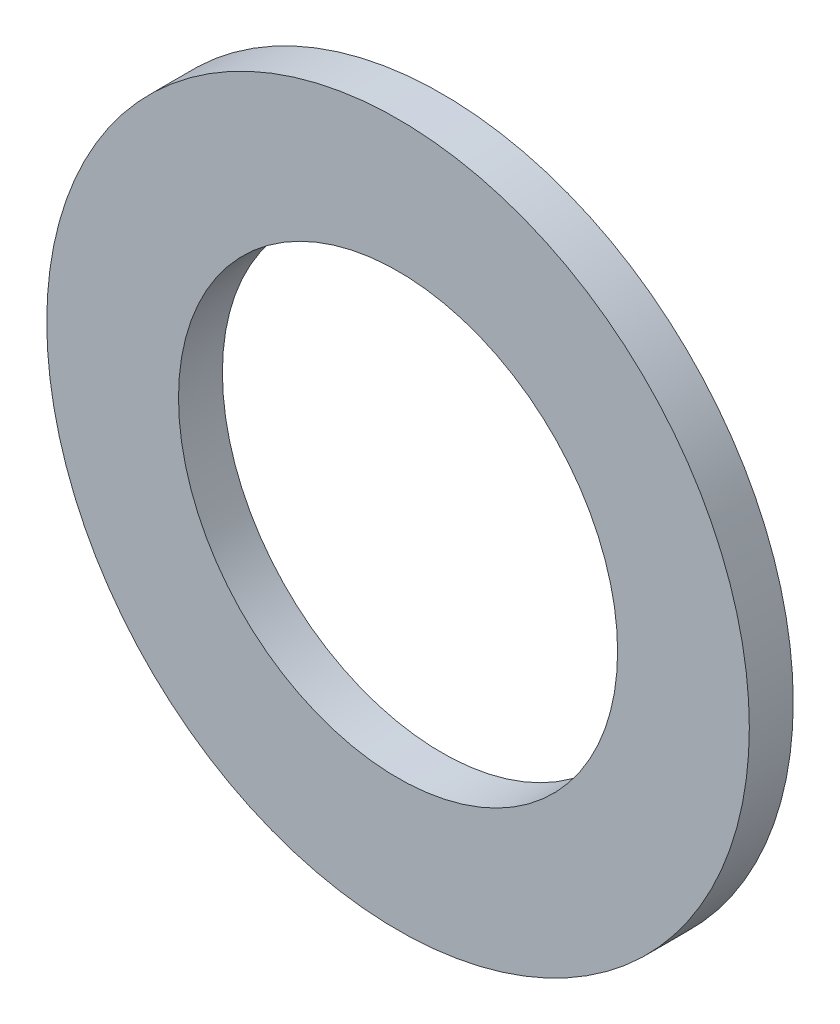
ISO-10303-21;
HEADER;
FILE_DESCRIPTION(('STEP AP214'),'2;1');
FILE_NAME('part.step','',(''),(''),'','','');
FILE_SCHEMA(('AUTOMOTIVE_DESIGN { 1 0 10303 214 1 1 1 1 }'));
ENDSEC;
DATA;
#1=APPLICATION_CONTEXT('core data for automotive mechanical design processes');
#2=APPLICATION_PROTOCOL_DEFINITION('international standard','automotive_design',2000,#1);
#3=PRODUCT_CONTEXT('',#1,'mechanical');
#4=PRODUCT('Part','Part','',(#3));
#5=PRODUCT_RELATED_PRODUCT_CATEGORY('part','',(#4));
#6=PRODUCT_DEFINITION_FORMATION('','',#4);
#7=PRODUCT_DEFINITION_CONTEXT('part definition',#1,'design');
#8=PRODUCT_DEFINITION('design','',#6,#7);
#9=PRODUCT_DEFINITION_SHAPE('','',#8);
#10=(LENGTH_UNIT() NAMED_UNIT(*) SI_UNIT(.MILLI.,.METRE.));
#11=(NAMED_UNIT(*) PLANE_ANGLE_UNIT() SI_UNIT($,.RADIAN.));
#12=(NAMED_UNIT(*) SI_UNIT($,.STERADIAN.) SOLID_ANGLE_UNIT());
#13=UNCERTAINTY_MEASURE_WITH_UNIT(LENGTH_MEASURE(1.E-05),#10,'distance_accuracy_value','');
#14=(GEOMETRIC_REPRESENTATION_CONTEXT(3) GLOBAL_UNCERTAINTY_ASSIGNED_CONTEXT((#13)) GLOBAL_UNIT_ASSIGNED_CONTEXT((#10,
#11,#12)) REPRESENTATION_CONTEXT('',''));
#15=CARTESIAN_POINT('',(0.,0.,0.));
#16=DIRECTION('',(0.,0.,1.));
#17=DIRECTION('',(1.,0.,0.));
#18=AXIS2_PLACEMENT_3D('',#15,#16,#17);
#19=CARTESIAN_POINT('',(0.,0.,1.));
#20=DIRECTION('',(0.,0.,1.));
#21=DIRECTION('',(1.,0.,0.));
#22=AXIS2_PLACEMENT_3D('',#19,#20,#21);
#23=PLANE('',#22);
#24=CARTESIAN_POINT('',(0.,0.,1.));
#25=DIRECTION('',(0.,0.,1.));
#26=DIRECTION('',(1.,0.,0.));
#27=AXIS2_PLACEMENT_3D('',#24,#25,#26);
#28=CIRCLE('',#27,8.);
#29=CARTESIAN_POINT('',(8.,0.,1.));
#30=VERTEX_POINT('',#29);
#31=EDGE_CURVE('E10',#30,#30,#28,.T.);
#32=ORIENTED_EDGE('',*,*,#31,.T.);
#33=EDGE_LOOP('',(#32));
#34=FACE_BOUND('',#33,.T.);
#35=CARTESIAN_POINT('',(0.,0.,1.));
#36=DIRECTION('',(0.,0.,1.));
#37=DIRECTION('',(1.,0.,0.));
#38=AXIS2_PLACEMENT_3D('',#35,#36,#37);
#39=CIRCLE('',#38,5.);
#40=CARTESIAN_POINT('',(5.,0.,1.));
#41=VERTEX_POINT('',#40);
#42=EDGE_CURVE('E50',#41,#41,#39,.T.);
#43=ORIENTED_EDGE('',*,*,#42,.F.);
#44=EDGE_LOOP('',(#43));
#45=FACE_BOUND('',#44,.T.);
#46=ADVANCED_FACE('F37',(#34,#45),#23,.T.);
#47=CARTESIAN_POINT('',(0.,0.,0.));
#48=DIRECTION('',(0.,0.,1.));
#49=DIRECTION('',(1.,0.,0.));
#50=AXIS2_PLACEMENT_3D('',#47,#48,#49);
#51=PLANE('',#50);
#52=CARTESIAN_POINT('',(0.,0.,0.));
#53=DIRECTION('',(0.,0.,1.));
#54=DIRECTION('',(1.,0.,0.));
#55=AXIS2_PLACEMENT_3D('',#52,#53,#54);
#56=CIRCLE('',#55,8.);
#57=CARTESIAN_POINT('',(8.,0.,0.));
#58=VERTEX_POINT('',#57);
#59=EDGE_CURVE('E41',#58,#58,#56,.T.);
#60=ORIENTED_EDGE('',*,*,#59,.F.);
#61=EDGE_LOOP('',(#60));
#62=FACE_BOUND('',#61,.T.);
#63=CARTESIAN_POINT('',(0.,0.,0.));
#64=DIRECTION('',(0.,0.,1.));
#65=DIRECTION('',(1.,0.,0.));
#66=AXIS2_PLACEMENT_3D('',#63,#64,#65);
#67=CIRCLE('',#66,5.);
#68=CARTESIAN_POINT('',(5.,0.,0.));
#69=VERTEX_POINT('',#68);
#70=EDGE_CURVE('E52',#69,#69,#67,.T.);
#71=ORIENTED_EDGE('',*,*,#70,.T.);
#72=EDGE_LOOP('',(#71));
#73=FACE_BOUND('',#72,.T.);
#74=ADVANCED_FACE('F64',(#62,#73),#51,.F.);
#75=CARTESIAN_POINT('',(0.,0.,1.));
#76=DIRECTION('',(0.,0.,-1.));
#77=DIRECTION('',(-1.,0.,0.));
#78=AXIS2_PLACEMENT_3D('',#75,#76,#77);
#79=CYLINDRICAL_SURFACE('',#78,8.);
#80=ORIENTED_EDGE('',*,*,#31,.F.);
#81=EDGE_LOOP('',(#80));
#82=FACE_BOUND('',#81,.T.);
#83=ORIENTED_EDGE('',*,*,#59,.T.);
#84=EDGE_LOOP('',(#83));
#85=FACE_BOUND('',#84,.T.);
#86=ADVANCED_FACE('F39',(#82,#85),#79,.T.);
#87=CARTESIAN_POINT('',(0.,0.,1.));
#88=DIRECTION('',(0.,0.,-1.));
#89=DIRECTION('',(-1.,0.,0.));
#90=AXIS2_PLACEMENT_3D('',#87,#88,#89);
#91=CYLINDRICAL_SURFACE('',#90,5.);
#92=ORIENTED_EDGE('',*,*,#42,.T.);
#93=EDGE_LOOP('',(#92));
#94=FACE_BOUND('',#93,.T.);
#95=ORIENTED_EDGE('',*,*,#70,.F.);
#96=EDGE_LOOP('',(#95));
#97=FACE_BOUND('',#96,.T.);
#98=ADVANCED_FACE('F60',(#94,#97),#91,.F.);
#99=CLOSED_SHELL('',(#46,#74,#86,#98));
#100=MANIFOLD_SOLID_BREP('B2',#99);
#101=ADVANCED_BREP_SHAPE_REPRESENTATION('',(#18,#100),#14);
#102=SHAPE_DEFINITION_REPRESENTATION(#9,#101);
ENDSEC;
END-ISO-10303-21;
